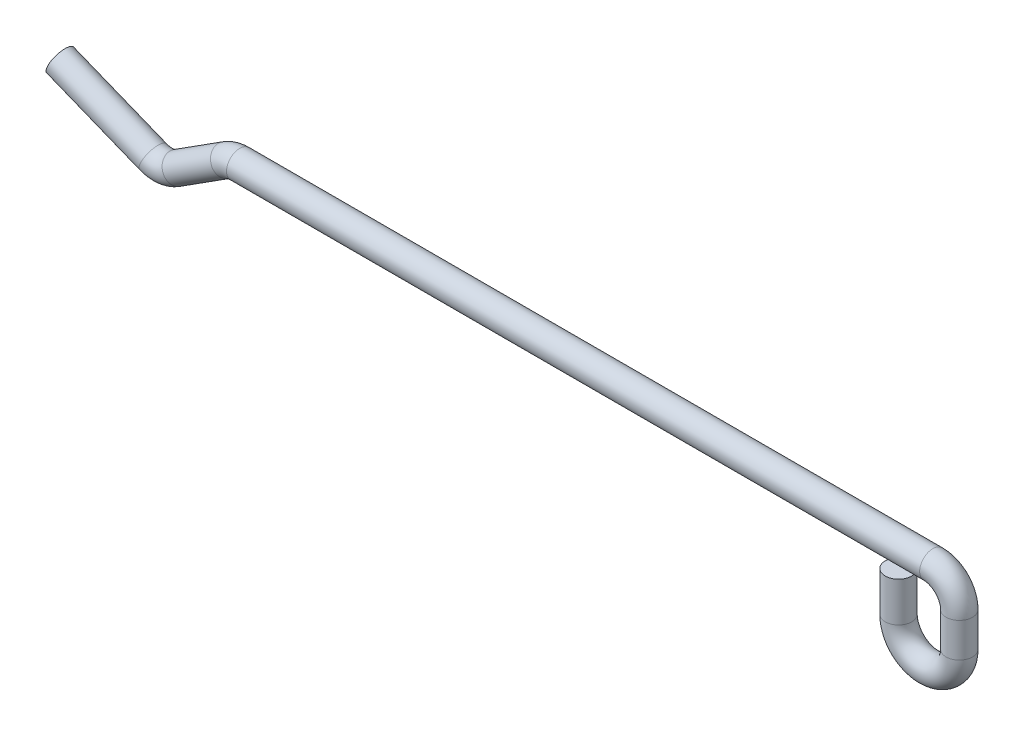
ISO-10303-21;
HEADER;
FILE_DESCRIPTION(('STEP AP214'),'2;1');
FILE_NAME('part.step','',(''),(''),'','','');
FILE_SCHEMA(('AUTOMOTIVE_DESIGN { 1 0 10303 214 1 1 1 1 }'));
ENDSEC;
DATA;
#1=APPLICATION_CONTEXT('core data for automotive mechanical design processes');
#2=APPLICATION_PROTOCOL_DEFINITION('international standard','automotive_design',2000,#1);
#3=PRODUCT_CONTEXT('',#1,'mechanical');
#4=PRODUCT('Part','Part','',(#3));
#5=PRODUCT_RELATED_PRODUCT_CATEGORY('part','',(#4));
#6=PRODUCT_DEFINITION_FORMATION('','',#4);
#7=PRODUCT_DEFINITION_CONTEXT('part definition',#1,'design');
#8=PRODUCT_DEFINITION('design','',#6,#7);
#9=PRODUCT_DEFINITION_SHAPE('','',#8);
#10=(LENGTH_UNIT() NAMED_UNIT(*) SI_UNIT(.MILLI.,.METRE.));
#11=(NAMED_UNIT(*) PLANE_ANGLE_UNIT() SI_UNIT($,.RADIAN.));
#12=(NAMED_UNIT(*) SI_UNIT($,.STERADIAN.) SOLID_ANGLE_UNIT());
#13=UNCERTAINTY_MEASURE_WITH_UNIT(LENGTH_MEASURE(1.E-05),#10,'distance_accuracy_value','');
#14=(GEOMETRIC_REPRESENTATION_CONTEXT(3) GLOBAL_UNCERTAINTY_ASSIGNED_CONTEXT((#13)) GLOBAL_UNIT_ASSIGNED_CONTEXT((#10,
#11,#12)) REPRESENTATION_CONTEXT('',''));
#15=CARTESIAN_POINT('',(0.,0.,0.));
#16=DIRECTION('',(0.,0.,1.));
#17=DIRECTION('',(1.,0.,0.));
#18=AXIS2_PLACEMENT_3D('',#15,#16,#17);
#19=CARTESIAN_POINT('',(-56.3710232392201,-1.2177613136877,0.));
#20=DIRECTION('',(-0.928195443882563,0.372093023255814,0.));
#21=DIRECTION('',(-0.372093023255814,-0.928195443882563,0.));
#22=AXIS2_PLACEMENT_3D('',#19,#20,#21);
#23=CYLINDRICAL_SURFACE('',#22,1.);
#24=CARTESIAN_POINT('',(-56.3710232392201,-1.2177613136877,0.));
#25=DIRECTION('',(0.928195443882568,-0.372093023255802,0.));
#26=DIRECTION('',(0.,0.,1.));
#27=AXIS2_PLACEMENT_3D('',#24,#25,#26);
#28=CIRCLE('',#27,1.);
#29=CARTESIAN_POINT('',(-56.7431162624759,-2.14595675757027,0.));
#30=VERTEX_POINT('',#29);
#31=EDGE_CURVE('E36',#30,#30,#28,.T.);
#32=CARTESIAN_POINT('',(-63.4,1.6,0.));
#33=DIRECTION('',(0.928195443882568,-0.372093023255802,0.));
#34=DIRECTION('',(0.,0.,1.));
#35=AXIS2_PLACEMENT_3D('',#32,#33,#34);
#36=CIRCLE('',#35,1.);
#37=CARTESIAN_POINT('',(-63.7720930232558,0.671804556117432,0.));
#38=VERTEX_POINT('',#37);
#39=EDGE_CURVE('E10',#38,#38,#36,.T.);
#40=CARTESIAN_POINT('',(-56.7431162624759,-2.14595675757027,0.));
#41=CARTESIAN_POINT('',(-56.8163347704007,-2.11660507721935,0.));
#42=CARTESIAN_POINT('',(-56.8895532783255,-2.08725339686844,0.));
#43=CARTESIAN_POINT('',(-57.0359902941751,-2.02855003616661,0.));
#44=CARTESIAN_POINT('',(-57.1092088020998,-1.9991983558157,0.));
#45=CARTESIAN_POINT('',(-57.2556458179494,-1.94049499511387,0.));
#46=CARTESIAN_POINT('',(-57.3288643258742,-1.91114331476296,0.));
#47=CARTESIAN_POINT('',(-57.4753013417238,-1.85243995406113,0.));
#48=CARTESIAN_POINT('',(-57.5485198496486,-1.82308827371022,0.));
#49=CARTESIAN_POINT('',(-57.6949568654982,-1.76438491300839,0.));
#50=CARTESIAN_POINT('',(-57.768175373423,-1.73503323265748,0.));
#51=CARTESIAN_POINT('',(-57.9146123892726,-1.67632987195565,0.));
#52=CARTESIAN_POINT('',(-57.9878308971973,-1.64697819160474,0.));
#53=CARTESIAN_POINT('',(-58.1342679130469,-1.58827483090291,0.));
#54=CARTESIAN_POINT('',(-58.2074864209717,-1.55892315055199,0.));
#55=CARTESIAN_POINT('',(-58.3539234368213,-1.50021978985017,0.));
#56=CARTESIAN_POINT('',(-58.4271419447461,-1.47086810949926,0.));
#57=CARTESIAN_POINT('',(-58.5735789605957,-1.41216474879743,0.));
#58=CARTESIAN_POINT('',(-58.6467974685205,-1.38281306844651,0.));
#59=CARTESIAN_POINT('',(-58.79323448437,-1.32410970774469,0.));
#60=CARTESIAN_POINT('',(-58.8664529922948,-1.29475802739377,0.));
#61=CARTESIAN_POINT('',(-59.0128900081444,-1.23605466669195,0.));
#62=CARTESIAN_POINT('',(-59.0861085160692,-1.20670298634103,0.));
#63=CARTESIAN_POINT('',(-59.2325455319188,-1.14799962563921,0.));
#64=CARTESIAN_POINT('',(-59.3057640398436,-1.11864794528829,0.));
#65=CARTESIAN_POINT('',(-59.4522010556932,-1.05994458458647,0.));
#66=CARTESIAN_POINT('',(-59.525419563618,-1.03059290423555,0.));
#67=CARTESIAN_POINT('',(-59.6718565794675,-0.971889543533725,0.));
#68=CARTESIAN_POINT('',(-59.7450750873923,-0.942537863182811,0.));
#69=CARTESIAN_POINT('',(-59.8915121032419,-0.883834502480984,0.));
#70=CARTESIAN_POINT('',(-59.9647306111667,-0.854482822130071,0.));
#71=CARTESIAN_POINT('',(-60.1111676270163,-0.795779461428244,0.));
#72=CARTESIAN_POINT('',(-60.1843861349411,-0.76642778107733,0.));
#73=CARTESIAN_POINT('',(-60.3308231507907,-0.707724420375503,0.));
#74=CARTESIAN_POINT('',(-60.4040416587154,-0.67837274002459,0.));
#75=CARTESIAN_POINT('',(-60.550478674565,-0.619669379322764,0.));
#76=CARTESIAN_POINT('',(-60.6236971824898,-0.590317698971849,0.));
#77=CARTESIAN_POINT('',(-60.7701341983394,-0.531614338270022,0.));
#78=CARTESIAN_POINT('',(-60.8433527062642,-0.502262657919108,0.));
#79=CARTESIAN_POINT('',(-60.9897897221138,-0.443559297217282,0.));
#80=CARTESIAN_POINT('',(-61.0630082300386,-0.414207616866369,0.));
#81=CARTESIAN_POINT('',(-61.2094452458882,-0.355504256164542,0.));
#82=CARTESIAN_POINT('',(-61.2826637538129,-0.326152575813627,0.));
#83=CARTESIAN_POINT('',(-61.4291007696625,-0.2674492151118,0.));
#84=CARTESIAN_POINT('',(-61.5023192775873,-0.238097534760888,0.));
#85=CARTESIAN_POINT('',(-61.6487562934369,-0.179394174059061,0.));
#86=CARTESIAN_POINT('',(-61.7219748013617,-0.150042493708146,0.));
#87=CARTESIAN_POINT('',(-61.8684118172113,-0.0913391330063192,0.));
#88=CARTESIAN_POINT('',(-61.9416303251361,-0.0619874526554063,0.));
#89=CARTESIAN_POINT('',(-62.0880673409856,-0.00328409195357959,0.));
#90=CARTESIAN_POINT('',(-62.1612858489104,0.0260675883973342,0.));
#91=CARTESIAN_POINT('',(-62.30772286476,0.0847709490991613,0.));
#92=CARTESIAN_POINT('',(-62.3809413726848,0.114122629450075,0.));
#93=CARTESIAN_POINT('',(-62.5273783885344,0.172825990151902,0.));
#94=CARTESIAN_POINT('',(-62.6005968964592,0.202177670502817,0.));
#95=CARTESIAN_POINT('',(-62.7470339123088,0.260881031204643,0.));
#96=CARTESIAN_POINT('',(-62.8202524202336,0.290232711555555,0.));
#97=CARTESIAN_POINT('',(-62.9666894360831,0.348936072257382,0.));
#98=CARTESIAN_POINT('',(-63.0399079440079,0.378287752608296,0.));
#99=CARTESIAN_POINT('',(-63.1863449598575,0.436991113310124,0.));
#100=CARTESIAN_POINT('',(-63.2595634677823,0.466342793661037,0.));
#101=CARTESIAN_POINT('',(-63.4060004836319,0.525046154362864,0.));
#102=CARTESIAN_POINT('',(-63.4792189915567,0.554397834713778,0.));
#103=CARTESIAN_POINT('',(-63.6256560074062,0.613101195415605,0.));
#104=CARTESIAN_POINT('',(-63.698874515331,0.642452875766518,0.));
#105=CARTESIAN_POINT('',(-63.7720930232558,0.671804556117432,0.));
#106=B_SPLINE_CURVE_WITH_KNOTS('',3,(#40,#41,#42,#43,#44,#45,#46,#47,#48,#49,#50,#51,#52,#53,
#54,#55,#56,#57,#58,#59,#60,#61,#62,#63,#64,#65,#66,#67,#68,#69,#70,#71,#72,#73,#74,#75,#76,#77,
#78,#79,#80,#81,#82,#83,#84,#85,#86,#87,#88,#89,#90,#91,#92,#93,#94,#95,#96,#97,#98,#99,#100,
#101,#102,#103,#104,#105),.UNSPECIFIED.,.F.,.F.,(4,2,2,2,2,2,2,2,2,2,2,2,2,2,2,2,2,2,2,2,2,2,2,
2,2,2,2,2,2,2,2,2,4),(0.,0.236647922829238,0.473295845658475,0.709943768487719,
0.946591691316957,1.1832396141462,1.41988753697544,1.65653545980468,1.89318338263392,
2.12983130546316,2.3664792282924,2.60312715112164,2.83977507395088,3.07642299678012,
3.31307091960936,3.5497188424386,3.78636676526784,4.02301468809708,4.25966261092632,
4.49631053375556,4.7329584565848,4.96960637941404,5.20625430224328,5.44290222507252,
5.67955014790176,5.916198070731,6.15284599356024,6.38949391638948,6.62614183921873,
6.86278976204797,7.0994376848772,7.33608560770644,7.57273353053568),.UNSPECIFIED.);
#107=EDGE_CURVE('BSEAM30',#30,#38,#106,.T.);
#108=ORIENTED_EDGE('',*,*,#31,.F.);
#109=ORIENTED_EDGE('',*,*,#39,.T.);
#110=ORIENTED_EDGE('',*,*,#107,.T.);
#111=ORIENTED_EDGE('',*,*,#107,.F.);
#112=EDGE_LOOP('',(#108,#110,#109,#111));
#113=FACE_BOUND('',#112,.T.);
#114=ADVANCED_FACE('F30',(#113),#23,.T.);
#115=CARTESIAN_POINT('',(-55.6268371927084,0.638629574077423,0.));
#116=DIRECTION('',(0.,0.,-1.));
#117=DIRECTION('',(-1.,0.,0.));
#118=AXIS2_PLACEMENT_3D('',#115,#116,#117);
#119=TOROIDAL_SURFACE('',#118,2.,1.);
#120=CARTESIAN_POINT('',(-54.5514043560066,-1.04762195334767,0.));
#121=DIRECTION('',(0.843125763712528,0.537716418350942,0.));
#122=DIRECTION('',(0.,0.,1.));
#123=AXIS2_PLACEMENT_3D('',#120,#121,#122);
#124=CIRCLE('',#123,1.);
#125=CARTESIAN_POINT('',(-54.0136879376557,-1.89074771706021,0.));
#126=VERTEX_POINT('',#125);
#127=EDGE_CURVE('E40',#126,#126,#124,.T.);
#128=CARTESIAN_POINT('',(-55.6268371927084,0.638629574077423,0.));
#129=DIRECTION('',(0.,0.,-1.));
#130=DIRECTION('',(-1.,0.,0.));
#131=AXIS2_PLACEMENT_3D('',#128,#129,#130);
#132=CIRCLE('',#131,3.);
#133=EDGE_CURVE('',#126,#30,#132,.T.);
#134=ORIENTED_EDGE('',*,*,#127,.F.);
#135=ORIENTED_EDGE('',*,*,#31,.T.);
#136=ORIENTED_EDGE('',*,*,#133,.T.);
#137=ORIENTED_EDGE('',*,*,#133,.F.);
#138=EDGE_LOOP('',(#134,#136,#135,#137));
#139=FACE_BOUND('',#138,.T.);
#140=ADVANCED_FACE('F104',(#139),#119,.T.);
#141=CARTESIAN_POINT('',(-50.8919496811435,1.28625152742505,0.));
#142=DIRECTION('',(-0.843125763712536,-0.53771641835093,0.));
#143=DIRECTION('',(0.53771641835093,-0.843125763712537,0.));
#144=AXIS2_PLACEMENT_3D('',#141,#142,#143);
#145=CYLINDRICAL_SURFACE('',#144,1.);
#146=CARTESIAN_POINT('',(-50.8919496811435,1.28625152742505,0.));
#147=DIRECTION('',(0.843125763712528,0.537716418350942,0.));
#148=DIRECTION('',(0.,0.,1.));
#149=AXIS2_PLACEMENT_3D('',#146,#147,#148);
#150=CIRCLE('',#149,1.);
#151=CARTESIAN_POINT('',(-51.4296660994945,2.12937729113758,0.));
#152=VERTEX_POINT('',#151);
#153=EDGE_CURVE('E44',#152,#152,#150,.T.);
#154=ORIENTED_EDGE('',*,*,#153,.F.);
#155=EDGE_LOOP('',(#154));
#156=FACE_BOUND('',#155,.T.);
#157=ORIENTED_EDGE('',*,*,#127,.T.);
#158=EDGE_LOOP('',(#157));
#159=FACE_BOUND('',#158,.T.);
#160=ADVANCED_FACE('F98',(#156,#159),#145,.T.);
#161=CARTESIAN_POINT('',(-49.8165168444417,-0.400000000000007,0.));
#162=DIRECTION('',(0.,0.,1.));
#163=DIRECTION('',(1.,0.,0.));
#164=AXIS2_PLACEMENT_3D('',#161,#162,#163);
#165=TOROIDAL_SURFACE('',#164,2.,1.);
#166=CARTESIAN_POINT('',(-49.8165168444417,1.59999999999999,0.));
#167=DIRECTION('',(1.,0.,0.));
#168=DIRECTION('',(0.,0.,1.));
#169=AXIS2_PLACEMENT_3D('',#166,#167,#168);
#170=CIRCLE('',#169,1.);
#171=CARTESIAN_POINT('',(-49.8165168444417,2.59999999999999,0.));
#172=VERTEX_POINT('',#171);
#173=EDGE_CURVE('E49',#172,#172,#170,.T.);
#174=CARTESIAN_POINT('',(-49.8165168444417,-0.400000000000007,0.));
#175=DIRECTION('',(0.,0.,1.));
#176=DIRECTION('',(1.,0.,0.));
#177=AXIS2_PLACEMENT_3D('',#174,#175,#176);
#178=CIRCLE('',#177,3.);
#179=EDGE_CURVE('',#172,#152,#178,.T.);
#180=ORIENTED_EDGE('',*,*,#173,.F.);
#181=ORIENTED_EDGE('',*,*,#153,.T.);
#182=ORIENTED_EDGE('',*,*,#179,.T.);
#183=ORIENTED_EDGE('',*,*,#179,.F.);
#184=EDGE_LOOP('',(#180,#182,#181,#183));
#185=FACE_BOUND('',#184,.T.);
#186=ADVANCED_FACE('F92',(#185),#165,.T.);
#187=CARTESIAN_POINT('',(2.59999999999997,1.6,0.));
#188=DIRECTION('',(-1.,0.,0.));
#189=DIRECTION('',(0.,-1.,0.));
#190=AXIS2_PLACEMENT_3D('',#187,#188,#189);
#191=CYLINDRICAL_SURFACE('',#190,1.);
#192=CARTESIAN_POINT('',(2.59999999999997,1.6,0.));
#193=DIRECTION('',(1.,0.,0.));
#194=DIRECTION('',(0.,0.,1.));
#195=AXIS2_PLACEMENT_3D('',#192,#193,#194);
#196=CIRCLE('',#195,1.);
#197=CARTESIAN_POINT('',(2.59999999999995,2.6,0.));
#198=VERTEX_POINT('',#197);
#199=EDGE_CURVE('E52',#198,#198,#196,.T.);
#200=ORIENTED_EDGE('',*,*,#199,.F.);
#201=EDGE_LOOP('',(#200));
#202=FACE_BOUND('',#201,.T.);
#203=ORIENTED_EDGE('',*,*,#173,.T.);
#204=EDGE_LOOP('',(#203));
#205=FACE_BOUND('',#204,.T.);
#206=ADVANCED_FACE('F86',(#202,#205),#191,.T.);
#207=CARTESIAN_POINT('',(2.6,-0.4,0.));
#208=DIRECTION('',(0.,0.,1.));
#209=DIRECTION('',(1.,0.,0.));
#210=AXIS2_PLACEMENT_3D('',#207,#208,#209);
#211=TOROIDAL_SURFACE('',#210,2.,1.);
#212=CARTESIAN_POINT('',(4.6,-0.399999999999969,0.));
#213=DIRECTION('',(0.,-1.,0.));
#214=DIRECTION('',(0.,0.,1.));
#215=AXIS2_PLACEMENT_3D('',#212,#213,#214);
#216=CIRCLE('',#215,1.);
#217=CARTESIAN_POINT('',(5.6,-0.399999999999953,0.));
#218=VERTEX_POINT('',#217);
#219=EDGE_CURVE('E55',#218,#218,#216,.T.);
#220=CARTESIAN_POINT('',(2.6,-0.4,0.));
#221=DIRECTION('',(0.,0.,1.));
#222=DIRECTION('',(1.,0.,0.));
#223=AXIS2_PLACEMENT_3D('',#220,#221,#222);
#224=CIRCLE('',#223,3.);
#225=EDGE_CURVE('',#218,#198,#224,.T.);
#226=ORIENTED_EDGE('',*,*,#219,.F.);
#227=ORIENTED_EDGE('',*,*,#199,.T.);
#228=ORIENTED_EDGE('',*,*,#225,.T.);
#229=ORIENTED_EDGE('',*,*,#225,.F.);
#230=EDGE_LOOP('',(#226,#228,#227,#229));
#231=FACE_BOUND('',#230,.T.);
#232=ADVANCED_FACE('F80',(#231),#211,.T.);
#233=CARTESIAN_POINT('',(4.6,-2.99999999999997,0.));
#234=DIRECTION('',(0.,1.,0.));
#235=DIRECTION('',(0.,0.,1.));
#236=AXIS2_PLACEMENT_3D('',#233,#234,#235);
#237=CYLINDRICAL_SURFACE('',#236,1.);
#238=CARTESIAN_POINT('',(4.6,-2.99999999999997,0.));
#239=DIRECTION('',(0.,-1.,0.));
#240=DIRECTION('',(0.,0.,1.));
#241=AXIS2_PLACEMENT_3D('',#238,#239,#240);
#242=CIRCLE('',#241,1.);
#243=CARTESIAN_POINT('',(5.6,-2.99999999999995,0.));
#244=VERTEX_POINT('',#243);
#245=EDGE_CURVE('E58',#244,#244,#242,.T.);
#246=ORIENTED_EDGE('',*,*,#245,.F.);
#247=EDGE_LOOP('',(#246));
#248=FACE_BOUND('',#247,.T.);
#249=ORIENTED_EDGE('',*,*,#219,.T.);
#250=EDGE_LOOP('',(#249));
#251=FACE_BOUND('',#250,.T.);
#252=ADVANCED_FACE('F74',(#248,#251),#237,.T.);
#253=CARTESIAN_POINT('',(2.3,-3.,0.));
#254=DIRECTION('',(0.,0.,1.));
#255=DIRECTION('',(1.,0.,0.));
#256=AXIS2_PLACEMENT_3D('',#253,#254,#255);
#257=TOROIDAL_SURFACE('',#256,2.3,1.);
#258=CARTESIAN_POINT('',(0.,-3.,0.));
#259=DIRECTION('',(0.,1.,0.));
#260=DIRECTION('',(0.,0.,1.));
#261=AXIS2_PLACEMENT_3D('',#258,#259,#260);
#262=CIRCLE('',#261,1.);
#263=CARTESIAN_POINT('',(-1.,-3.,0.));
#264=VERTEX_POINT('',#263);
#265=EDGE_CURVE('E61',#264,#264,#262,.T.);
#266=CARTESIAN_POINT('',(2.3,-3.,0.));
#267=DIRECTION('',(0.,0.,1.));
#268=DIRECTION('',(1.,0.,0.));
#269=AXIS2_PLACEMENT_3D('',#266,#267,#268);
#270=CIRCLE('',#269,3.3);
#271=EDGE_CURVE('',#264,#244,#270,.T.);
#272=ORIENTED_EDGE('',*,*,#265,.F.);
#273=ORIENTED_EDGE('',*,*,#245,.T.);
#274=ORIENTED_EDGE('',*,*,#271,.T.);
#275=ORIENTED_EDGE('',*,*,#271,.F.);
#276=EDGE_LOOP('',(#272,#274,#273,#275));
#277=FACE_BOUND('',#276,.T.);
#278=ADVANCED_FACE('F71',(#277),#257,.T.);
#279=CARTESIAN_POINT('',(0.,-3.,0.));
#280=DIRECTION('',(0.,1.,0.));
#281=DIRECTION('',(0.,0.,1.));
#282=AXIS2_PLACEMENT_3D('',#279,#280,#281);
#283=CYLINDRICAL_SURFACE('',#282,1.);
#284=ORIENTED_EDGE('',*,*,#265,.T.);
#285=EDGE_LOOP('',(#284));
#286=FACE_BOUND('',#285,.T.);
#287=CARTESIAN_POINT('',(0.,0.,0.));
#288=DIRECTION('',(0.,1.,0.));
#289=DIRECTION('',(0.,0.,1.));
#290=AXIS2_PLACEMENT_3D('',#287,#288,#289);
#291=CIRCLE('',#290,1.);
#292=CARTESIAN_POINT('',(0.,0.,1.));
#293=VERTEX_POINT('',#292);
#294=EDGE_CURVE('E62',#293,#293,#291,.T.);
#295=ORIENTED_EDGE('',*,*,#294,.F.);
#296=EDGE_LOOP('',(#295));
#297=FACE_BOUND('',#296,.T.);
#298=ADVANCED_FACE('F68',(#286,#297),#283,.T.);
#299=CARTESIAN_POINT('',(-63.4,1.6,0.));
#300=DIRECTION('',(0.928195443882568,-0.372093023255802,0.));
#301=DIRECTION('',(0.,0.,1.));
#302=AXIS2_PLACEMENT_3D('',#299,#300,#301);
#303=PLANE('',#302);
#304=ORIENTED_EDGE('',*,*,#39,.F.);
#305=EDGE_LOOP('',(#304));
#306=FACE_BOUND('',#305,.T.);
#307=ADVANCED_FACE('F116',(#306),#303,.F.);
#308=CARTESIAN_POINT('',(0.,0.,0.));
#309=DIRECTION('',(0.,1.,0.));
#310=DIRECTION('',(0.,0.,1.));
#311=AXIS2_PLACEMENT_3D('',#308,#309,#310);
#312=PLANE('',#311);
#313=ORIENTED_EDGE('',*,*,#294,.T.);
#314=EDGE_LOOP('',(#313));
#315=FACE_BOUND('',#314,.T.);
#316=ADVANCED_FACE('F117',(#315),#312,.T.);
#317=CLOSED_SHELL('',(#114,#140,#160,#186,#206,#232,#252,#278,#298,#307,#316));
#318=MANIFOLD_SOLID_BREP('B2',#317);
#319=ADVANCED_BREP_SHAPE_REPRESENTATION('',(#18,#318),#14);
#320=SHAPE_DEFINITION_REPRESENTATION(#9,#319);
ENDSEC;
END-ISO-10303-21;
